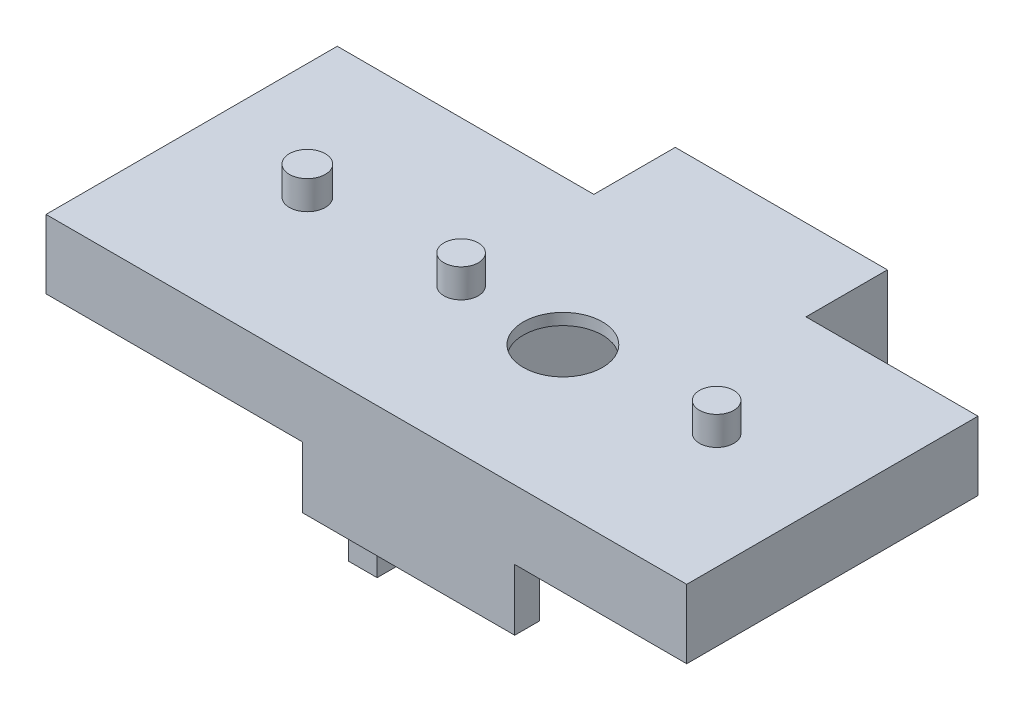
ISO-10303-21;
HEADER;
FILE_DESCRIPTION(('STEP AP214'),'2;1');
FILE_NAME('part.step','',(''),(''),'','','');
FILE_SCHEMA(('AUTOMOTIVE_DESIGN { 1 0 10303 214 1 1 1 1 }'));
ENDSEC;
DATA;
#1=APPLICATION_CONTEXT('core data for automotive mechanical design processes');
#2=APPLICATION_PROTOCOL_DEFINITION('international standard','automotive_design',2000,#1);
#3=PRODUCT_CONTEXT('',#1,'mechanical');
#4=PRODUCT('Part','Part','',(#3));
#5=PRODUCT_RELATED_PRODUCT_CATEGORY('part','',(#4));
#6=PRODUCT_DEFINITION_FORMATION('','',#4);
#7=PRODUCT_DEFINITION_CONTEXT('part definition',#1,'design');
#8=PRODUCT_DEFINITION('design','',#6,#7);
#9=PRODUCT_DEFINITION_SHAPE('','',#8);
#10=(LENGTH_UNIT() NAMED_UNIT(*) SI_UNIT(.MILLI.,.METRE.));
#11=(NAMED_UNIT(*) PLANE_ANGLE_UNIT() SI_UNIT($,.RADIAN.));
#12=(NAMED_UNIT(*) SI_UNIT($,.STERADIAN.) SOLID_ANGLE_UNIT());
#13=UNCERTAINTY_MEASURE_WITH_UNIT(LENGTH_MEASURE(1.E-05),#10,'distance_accuracy_value','');
#14=(GEOMETRIC_REPRESENTATION_CONTEXT(3) GLOBAL_UNCERTAINTY_ASSIGNED_CONTEXT((#13)) GLOBAL_UNIT_ASSIGNED_CONTEXT((#10,
#11,#12)) REPRESENTATION_CONTEXT('',''));
#15=CARTESIAN_POINT('',(0.,0.,0.));
#16=DIRECTION('',(0.,0.,1.));
#17=DIRECTION('',(1.,0.,0.));
#18=AXIS2_PLACEMENT_3D('',#15,#16,#17);
#19=CARTESIAN_POINT('',(0.,0.,0.));
#20=DIRECTION('',(1.,0.,0.));
#21=DIRECTION('',(0.,0.,-1.));
#22=AXIS2_PLACEMENT_3D('',#19,#20,#21);
#23=PLANE('',#22);
#24=CARTESIAN_POINT('',(0.,-13.,-24.2));
#25=DIRECTION('',(1.,0.,0.));
#26=DIRECTION('',(0.,0.,-1.));
#27=AXIS2_PLACEMENT_3D('',#24,#25,#26);
#28=CIRCLE('',#27,2.2);
#29=CARTESIAN_POINT('',(0.,-13.,-26.4));
#30=VERTEX_POINT('',#29);
#31=EDGE_CURVE('E408',#30,#30,#28,.T.);
#32=ORIENTED_EDGE('',*,*,#31,.T.);
#33=EDGE_LOOP('',(#32));
#34=FACE_BOUND('',#33,.T.);
#35=CARTESIAN_POINT('',(0.,-3.1,-24.2));
#36=DIRECTION('',(1.,0.,0.));
#37=DIRECTION('',(0.,0.,-1.));
#38=AXIS2_PLACEMENT_3D('',#35,#36,#37);
#39=CIRCLE('',#38,2.2);
#40=CARTESIAN_POINT('',(0.,-3.1,-26.4));
#41=VERTEX_POINT('',#40);
#42=EDGE_CURVE('E413',#41,#41,#39,.T.);
#43=ORIENTED_EDGE('',*,*,#42,.T.);
#44=EDGE_LOOP('',(#43));
#45=FACE_BOUND('',#44,.T.);
#46=CARTESIAN_POINT('',(0.,-13.,24.8));
#47=DIRECTION('',(1.,0.,0.));
#48=DIRECTION('',(0.,0.,-1.));
#49=AXIS2_PLACEMENT_3D('',#46,#47,#48);
#50=CIRCLE('',#49,2.2);
#51=CARTESIAN_POINT('',(0.,-13.,22.6));
#52=VERTEX_POINT('',#51);
#53=EDGE_CURVE('E421',#52,#52,#50,.T.);
#54=ORIENTED_EDGE('',*,*,#53,.T.);
#55=EDGE_LOOP('',(#54));
#56=FACE_BOUND('',#55,.T.);
#57=CARTESIAN_POINT('',(0.,-3.1,24.8));
#58=DIRECTION('',(1.,0.,0.));
#59=DIRECTION('',(0.,0.,-1.));
#60=AXIS2_PLACEMENT_3D('',#57,#58,#59);
#61=CIRCLE('',#60,2.2);
#62=CARTESIAN_POINT('',(0.,-3.1,22.6));
#63=VERTEX_POINT('',#62);
#64=EDGE_CURVE('E429',#63,#63,#61,.T.);
#65=ORIENTED_EDGE('',*,*,#64,.T.);
#66=EDGE_LOOP('',(#65));
#67=FACE_BOUND('',#66,.T.);
#68=DIRECTION('',(0.,0.,1.));
#69=VECTOR('',#68,1.);
#70=CARTESIAN_POINT('',(0.,5.,36.5));
#71=LINE('',#70,#69);
#72=CARTESIAN_POINT('',(0.,4.99999999999999,-14.3));
#73=VERTEX_POINT('',#72);
#74=CARTESIAN_POINT('',(0.,5.,36.5));
#75=VERTEX_POINT('',#74);
#76=EDGE_CURVE('E222',#73,#75,#71,.T.);
#77=ORIENTED_EDGE('',*,*,#76,.F.);
#78=DIRECTION('',(0.,-1.,0.));
#79=VECTOR('',#78,1.);
#80=CARTESIAN_POINT('',(0.,17.,-14.3));
#81=LINE('',#80,#79);
#82=CARTESIAN_POINT('',(0.,17.,-14.3));
#83=VERTEX_POINT('',#82);
#84=EDGE_CURVE('E57',#83,#73,#81,.T.);
#85=ORIENTED_EDGE('',*,*,#84,.F.);
#86=DIRECTION('',(0.,0.,1.));
#87=VECTOR('',#86,1.);
#88=CARTESIAN_POINT('',(0.,17.,28.5));
#89=LINE('',#88,#87);
#90=CARTESIAN_POINT('',(0.,17.,-28.5));
#91=VERTEX_POINT('',#90);
#92=EDGE_CURVE('E456',#91,#83,#89,.T.);
#93=ORIENTED_EDGE('',*,*,#92,.F.);
#94=DIRECTION('',(0.,1.,0.));
#95=VECTOR('',#94,1.);
#96=CARTESIAN_POINT('',(0.,17.,-28.5));
#97=LINE('',#96,#95);
#98=CARTESIAN_POINT('',(0.,-17.,-28.5));
#99=VERTEX_POINT('',#98);
#100=EDGE_CURVE('E437',#99,#91,#97,.T.);
#101=ORIENTED_EDGE('',*,*,#100,.F.);
#102=DIRECTION('',(0.,0.,-1.));
#103=VECTOR('',#102,1.);
#104=CARTESIAN_POINT('',(0.,-17.,28.5));
#105=LINE('',#104,#103);
#106=CARTESIAN_POINT('',(0.,-17.,28.5));
#107=VERTEX_POINT('',#106);
#108=EDGE_CURVE('E446',#107,#99,#105,.T.);
#109=ORIENTED_EDGE('',*,*,#108,.F.);
#110=DIRECTION('',(0.,-1.,0.));
#111=VECTOR('',#110,1.);
#112=CARTESIAN_POINT('',(0.,17.,28.5));
#113=LINE('',#112,#111);
#114=CARTESIAN_POINT('',(0.,-5.6960506008831,28.5));
#115=VERTEX_POINT('',#114);
#116=EDGE_CURVE('E459',#115,#107,#113,.T.);
#117=ORIENTED_EDGE('',*,*,#116,.F.);
#118=DIRECTION('',(0.,0.,-1.));
#119=VECTOR('',#118,1.);
#120=CARTESIAN_POINT('',(0.,-5.6960506008831,36.5));
#121=LINE('',#120,#119);
#122=CARTESIAN_POINT('',(0.,-5.6960506008831,36.5));
#123=VERTEX_POINT('',#122);
#124=EDGE_CURVE('E379',#123,#115,#121,.T.);
#125=ORIENTED_EDGE('',*,*,#124,.F.);
#126=DIRECTION('',(0.,-1.,0.));
#127=VECTOR('',#126,1.);
#128=CARTESIAN_POINT('',(0.,-5.6960506008831,36.5));
#129=LINE('',#128,#127);
#130=EDGE_CURVE('E63',#75,#123,#129,.T.);
#131=ORIENTED_EDGE('',*,*,#130,.F.);
#132=EDGE_LOOP('',(#77,#85,#93,#101,#109,#117,#125,#131));
#133=FACE_BOUND('',#132,.T.);
#134=ADVANCED_FACE('F41',(#34,#45,#56,#67,#133),#23,.F.);
#135=CARTESIAN_POINT('',(37.,0.,0.));
#136=DIRECTION('',(-1.,0.,0.));
#137=DIRECTION('',(0.,0.,1.));
#138=AXIS2_PLACEMENT_3D('',#135,#136,#137);
#139=PLANE('',#138);
#140=DIRECTION('',(0.,1.,0.));
#141=VECTOR('',#140,1.);
#142=CARTESIAN_POINT('',(37.,17.,-14.3));
#143=LINE('',#142,#141);
#144=CARTESIAN_POINT('',(37.,5.,-14.3));
#145=VERTEX_POINT('',#144);
#146=CARTESIAN_POINT('',(37.,17.,-14.3));
#147=VERTEX_POINT('',#146);
#148=EDGE_CURVE('E249',#145,#147,#143,.T.);
#149=ORIENTED_EDGE('',*,*,#148,.F.);
#150=DIRECTION('',(0.,0.,-1.));
#151=VECTOR('',#150,1.);
#152=CARTESIAN_POINT('',(37.,5.,36.5));
#153=LINE('',#152,#151);
#154=CARTESIAN_POINT('',(37.,5.,36.5));
#155=VERTEX_POINT('',#154);
#156=EDGE_CURVE('E245',#155,#145,#153,.T.);
#157=ORIENTED_EDGE('',*,*,#156,.F.);
#158=DIRECTION('',(0.,1.,0.));
#159=VECTOR('',#158,1.);
#160=CARTESIAN_POINT('',(37.,17.,36.5));
#161=LINE('',#160,#159);
#162=CARTESIAN_POINT('',(37.,-5.6960506008831,36.5));
#163=VERTEX_POINT('',#162);
#164=EDGE_CURVE('E205',#163,#155,#161,.T.);
#165=ORIENTED_EDGE('',*,*,#164,.F.);
#166=DIRECTION('',(0.,0.,-1.));
#167=VECTOR('',#166,1.);
#168=CARTESIAN_POINT('',(37.,-5.6960506008831,36.5));
#169=LINE('',#168,#167);
#170=CARTESIAN_POINT('',(37.,-5.6960506008831,32.1713747041326));
#171=VERTEX_POINT('',#170);
#172=EDGE_CURVE('E321',#163,#171,#169,.T.);
#173=ORIENTED_EDGE('',*,*,#172,.T.);
#174=DIRECTION('',(0.,1.,0.));
#175=VECTOR('',#174,1.);
#176=CARTESIAN_POINT('',(37.,-5.6960506008831,32.1713747041326));
#177=LINE('',#176,#175);
#178=CARTESIAN_POINT('',(37.,2.08946819583389,32.1713747041326));
#179=VERTEX_POINT('',#178);
#180=EDGE_CURVE('E324',#171,#179,#177,.T.);
#181=ORIENTED_EDGE('',*,*,#180,.T.);
#182=DIRECTION('',(0.,0.,-1.));
#183=VECTOR('',#182,1.);
#184=CARTESIAN_POINT('',(37.,2.08946819583389,32.1713747041326));
#185=LINE('',#184,#183);
#186=CARTESIAN_POINT('',(37.,2.08946819583389,-28.5));
#187=VERTEX_POINT('',#186);
#188=EDGE_CURVE('E328',#179,#187,#185,.T.);
#189=ORIENTED_EDGE('',*,*,#188,.T.);
#190=DIRECTION('',(0.,1.,0.));
#191=VECTOR('',#190,1.);
#192=CARTESIAN_POINT('',(37.,17.,-28.5));
#193=LINE('',#192,#191);
#194=CARTESIAN_POINT('',(37.,17.,-28.5));
#195=VERTEX_POINT('',#194);
#196=EDGE_CURVE('E298',#187,#195,#193,.T.);
#197=ORIENTED_EDGE('',*,*,#196,.T.);
#198=DIRECTION('',(0.,0.,1.));
#199=VECTOR('',#198,1.);
#200=CARTESIAN_POINT('',(37.,17.,28.5));
#201=LINE('',#200,#199);
#202=EDGE_CURVE('E388',#195,#147,#201,.T.);
#203=ORIENTED_EDGE('',*,*,#202,.T.);
#204=EDGE_LOOP('',(#149,#157,#165,#173,#181,#189,#197,#203));
#205=FACE_BOUND('',#204,.T.);
#206=ADVANCED_FACE('F547',(#205),#139,.F.);
#207=CARTESIAN_POINT('',(37.,12.,-28.5));
#208=DIRECTION('',(0.,1.,0.));
#209=DIRECTION('',(0.,0.,1.));
#210=AXIS2_PLACEMENT_3D('',#207,#208,#209);
#211=PLANE('',#210);
#212=DIRECTION('',(0.,0.,1.));
#213=VECTOR('',#212,1.);
#214=CARTESIAN_POINT('',(31.,12.,-28.5));
#215=LINE('',#214,#213);
#216=CARTESIAN_POINT('',(31.,12.,-28.5));
#217=VERTEX_POINT('',#216);
#218=CARTESIAN_POINT('',(31.,12.,-19.5));
#219=VERTEX_POINT('',#218);
#220=EDGE_CURVE('E276',#217,#219,#215,.T.);
#221=ORIENTED_EDGE('',*,*,#220,.T.);
#222=DIRECTION('',(-1.,0.,0.));
#223=VECTOR('',#222,1.);
#224=CARTESIAN_POINT('',(37.,12.,-19.5));
#225=LINE('',#224,#223);
#226=CARTESIAN_POINT('',(5.,12.,-19.5));
#227=VERTEX_POINT('',#226);
#228=EDGE_CURVE('E312',#219,#227,#225,.T.);
#229=ORIENTED_EDGE('',*,*,#228,.T.);
#230=DIRECTION('',(0.,0.,-1.));
#231=VECTOR('',#230,1.);
#232=CARTESIAN_POINT('',(5.,12.,-28.5));
#233=LINE('',#232,#231);
#234=CARTESIAN_POINT('',(5.,12.,-28.5));
#235=VERTEX_POINT('',#234);
#236=EDGE_CURVE('E303',#227,#235,#233,.T.);
#237=ORIENTED_EDGE('',*,*,#236,.T.);
#238=DIRECTION('',(-1.,0.,0.));
#239=VECTOR('',#238,1.);
#240=CARTESIAN_POINT('',(37.,12.,-28.5));
#241=LINE('',#240,#239);
#242=EDGE_CURVE('E302',#217,#235,#241,.T.);
#243=ORIENTED_EDGE('',*,*,#242,.F.);
#244=EDGE_LOOP('',(#221,#229,#237,#243));
#245=FACE_BOUND('',#244,.T.);
#246=ADVANCED_FACE('F531',(#245),#211,.F.);
#247=CARTESIAN_POINT('',(37.,10.5,20.));
#248=DIRECTION('',(0.,1.,0.));
#249=DIRECTION('',(0.,0.,1.));
#250=AXIS2_PLACEMENT_3D('',#247,#248,#249);
#251=PLANE('',#250);
#252=DIRECTION('',(0.,0.,1.));
#253=VECTOR('',#252,1.);
#254=CARTESIAN_POINT('',(31.,10.5,-28.5));
#255=LINE('',#254,#253);
#256=CARTESIAN_POINT('',(31.,10.5,20.));
#257=VERTEX_POINT('',#256);
#258=CARTESIAN_POINT('',(31.,10.5,29.6551085278622));
#259=VERTEX_POINT('',#258);
#260=EDGE_CURVE('E286',#257,#259,#255,.T.);
#261=ORIENTED_EDGE('',*,*,#260,.T.);
#262=DIRECTION('',(-1.,0.,0.));
#263=VECTOR('',#262,1.);
#264=CARTESIAN_POINT('',(37.,10.5,29.6551085278622));
#265=LINE('',#264,#263);
#266=CARTESIAN_POINT('',(5.,10.5,29.6551085278622));
#267=VERTEX_POINT('',#266);
#268=EDGE_CURVE('E332',#259,#267,#265,.T.);
#269=ORIENTED_EDGE('',*,*,#268,.T.);
#270=DIRECTION('',(0.,0.,-1.));
#271=VECTOR('',#270,1.);
#272=CARTESIAN_POINT('',(5.,10.5,20.));
#273=LINE('',#272,#271);
#274=CARTESIAN_POINT('',(5.,10.5,20.));
#275=VERTEX_POINT('',#274);
#276=EDGE_CURVE('E393',#267,#275,#273,.T.);
#277=ORIENTED_EDGE('',*,*,#276,.T.);
#278=DIRECTION('',(-1.,0.,0.));
#279=VECTOR('',#278,1.);
#280=CARTESIAN_POINT('',(37.,10.5,20.));
#281=LINE('',#280,#279);
#282=EDGE_CURVE('E404',#257,#275,#281,.T.);
#283=ORIENTED_EDGE('',*,*,#282,.F.);
#284=EDGE_LOOP('',(#261,#269,#277,#283));
#285=FACE_BOUND('',#284,.T.);
#286=ADVANCED_FACE('F556',(#285),#251,.F.);
#287=CARTESIAN_POINT('',(37.,10.5,29.6551085278622));
#288=DIRECTION('',(0.,0.,1.));
#289=DIRECTION('',(1.,0.,0.));
#290=AXIS2_PLACEMENT_3D('',#287,#288,#289);
#291=PLANE('',#290);
#292=DIRECTION('',(0.,1.,0.));
#293=VECTOR('',#292,1.);
#294=CARTESIAN_POINT('',(31.,2.08946819583389,29.6551085278622));
#295=LINE('',#294,#293);
#296=CARTESIAN_POINT('',(31.,2.08946819583389,29.6551085278622));
#297=VERTEX_POINT('',#296);
#298=EDGE_CURVE('E279',#297,#259,#295,.T.);
#299=ORIENTED_EDGE('',*,*,#298,.F.);
#300=DIRECTION('',(-1.,0.,0.));
#301=VECTOR('',#300,1.);
#302=CARTESIAN_POINT('',(37.,2.08946819583389,29.6551085278622));
#303=LINE('',#302,#301);
#304=CARTESIAN_POINT('',(5.,2.08946819583389,29.6551085278622));
#305=VERTEX_POINT('',#304);
#306=EDGE_CURVE('E344',#297,#305,#303,.T.);
#307=ORIENTED_EDGE('',*,*,#306,.T.);
#308=DIRECTION('',(0.,1.,0.));
#309=VECTOR('',#308,1.);
#310=CARTESIAN_POINT('',(5.,10.5,29.6551085278622));
#311=LINE('',#310,#309);
#312=EDGE_CURVE('E325',#305,#267,#311,.T.);
#313=ORIENTED_EDGE('',*,*,#312,.T.);
#314=ORIENTED_EDGE('',*,*,#268,.F.);
#315=EDGE_LOOP('',(#299,#307,#313,#314));
#316=FACE_BOUND('',#315,.T.);
#317=ADVANCED_FACE('F554',(#316),#291,.F.);
#318=CARTESIAN_POINT('',(5.,0.,0.));
#319=DIRECTION('',(1.,0.,0.));
#320=DIRECTION('',(0.,0.,-1.));
#321=AXIS2_PLACEMENT_3D('',#318,#319,#320);
#322=PLANE('',#321);
#323=CARTESIAN_POINT('',(5.,-3.1,-24.2));
#324=DIRECTION('',(1.,0.,0.));
#325=DIRECTION('',(0.,0.,-1.));
#326=AXIS2_PLACEMENT_3D('',#323,#324,#325);
#327=CIRCLE('',#326,2.2);
#328=CARTESIAN_POINT('',(5.,-3.1,-26.4));
#329=VERTEX_POINT('',#328);
#330=EDGE_CURVE('E417',#329,#329,#327,.T.);
#331=ORIENTED_EDGE('',*,*,#330,.F.);
#332=EDGE_LOOP('',(#331));
#333=FACE_BOUND('',#332,.T.);
#334=CARTESIAN_POINT('',(5.,-3.1,24.8));
#335=DIRECTION('',(1.,0.,0.));
#336=DIRECTION('',(0.,0.,-1.));
#337=AXIS2_PLACEMENT_3D('',#334,#335,#336);
#338=CIRCLE('',#337,2.2);
#339=CARTESIAN_POINT('',(5.,-3.1,22.6));
#340=VERTEX_POINT('',#339);
#341=EDGE_CURVE('E433',#340,#340,#338,.T.);
#342=ORIENTED_EDGE('',*,*,#341,.F.);
#343=EDGE_LOOP('',(#342));
#344=FACE_BOUND('',#343,.T.);
#345=CARTESIAN_POINT('',(5.,-13.,24.8));
#346=DIRECTION('',(1.,0.,0.));
#347=DIRECTION('',(0.,0.,-1.));
#348=AXIS2_PLACEMENT_3D('',#345,#346,#347);
#349=CIRCLE('',#348,2.2);
#350=CARTESIAN_POINT('',(5.,-13.,22.6));
#351=VERTEX_POINT('',#350);
#352=EDGE_CURVE('E425',#351,#351,#349,.T.);
#353=ORIENTED_EDGE('',*,*,#352,.F.);
#354=EDGE_LOOP('',(#353));
#355=FACE_BOUND('',#354,.T.);
#356=CARTESIAN_POINT('',(5.,-13.,-24.2));
#357=DIRECTION('',(1.,0.,0.));
#358=DIRECTION('',(0.,0.,-1.));
#359=AXIS2_PLACEMENT_3D('',#356,#357,#358);
#360=CIRCLE('',#359,2.2);
#361=CARTESIAN_POINT('',(5.,-13.,-26.4));
#362=VERTEX_POINT('',#361);
#363=EDGE_CURVE('E409',#362,#362,#360,.T.);
#364=ORIENTED_EDGE('',*,*,#363,.F.);
#365=EDGE_LOOP('',(#364));
#366=FACE_BOUND('',#365,.T.);
#367=DIRECTION('',(0.,-1.,0.));
#368=VECTOR('',#367,1.);
#369=CARTESIAN_POINT('',(5.,12.,-19.5));
#370=LINE('',#369,#368);
#371=CARTESIAN_POINT('',(5.,15.,-19.5));
#372=VERTEX_POINT('',#371);
#373=EDGE_CURVE('E297',#372,#227,#370,.T.);
#374=ORIENTED_EDGE('',*,*,#373,.F.);
#375=DIRECTION('',(0.,0.,-1.));
#376=VECTOR('',#375,1.);
#377=CARTESIAN_POINT('',(5.,15.,-12.));
#378=LINE('',#377,#376);
#379=CARTESIAN_POINT('',(5.,15.,20.));
#380=VERTEX_POINT('',#379);
#381=EDGE_CURVE('E392',#380,#372,#378,.T.);
#382=ORIENTED_EDGE('',*,*,#381,.F.);
#383=DIRECTION('',(0.,1.,0.));
#384=VECTOR('',#383,1.);
#385=CARTESIAN_POINT('',(5.,15.,20.));
#386=LINE('',#385,#384);
#387=EDGE_CURVE('E396',#275,#380,#386,.T.);
#388=ORIENTED_EDGE('',*,*,#387,.F.);
#389=ORIENTED_EDGE('',*,*,#276,.F.);
#390=ORIENTED_EDGE('',*,*,#312,.F.);
#391=DIRECTION('',(0.,0.,-1.));
#392=VECTOR('',#391,1.);
#393=CARTESIAN_POINT('',(5.,2.08946819583389,32.1713747041326));
#394=LINE('',#393,#392);
#395=CARTESIAN_POINT('',(5.,2.08946819583389,32.1713747041326));
#396=VERTEX_POINT('',#395);
#397=EDGE_CURVE('E335',#396,#305,#394,.T.);
#398=ORIENTED_EDGE('',*,*,#397,.F.);
#399=DIRECTION('',(0.,1.,0.));
#400=VECTOR('',#399,1.);
#401=CARTESIAN_POINT('',(5.,-5.6960506008831,32.1713747041326));
#402=LINE('',#401,#400);
#403=CARTESIAN_POINT('',(5.,-5.6960506008831,32.1713747041326));
#404=VERTEX_POINT('',#403);
#405=EDGE_CURVE('E320',#404,#396,#402,.T.);
#406=ORIENTED_EDGE('',*,*,#405,.F.);
#407=DIRECTION('',(0.,0.,-1.));
#408=VECTOR('',#407,1.);
#409=CARTESIAN_POINT('',(5.,-5.6960506008831,36.5));
#410=LINE('',#409,#408);
#411=CARTESIAN_POINT('',(5.,-5.6960506008831,28.5));
#412=VERTEX_POINT('',#411);
#413=EDGE_CURVE('E204',#404,#412,#410,.T.);
#414=ORIENTED_EDGE('',*,*,#413,.T.);
#415=DIRECTION('',(0.,-1.,0.));
#416=VECTOR('',#415,1.);
#417=CARTESIAN_POINT('',(5.,17.,28.5));
#418=LINE('',#417,#416);
#419=CARTESIAN_POINT('',(5.,-17.,28.5));
#420=VERTEX_POINT('',#419);
#421=EDGE_CURVE('E445',#412,#420,#418,.T.);
#422=ORIENTED_EDGE('',*,*,#421,.T.);
#423=DIRECTION('',(0.,0.,-1.));
#424=VECTOR('',#423,1.);
#425=CARTESIAN_POINT('',(5.,-17.,28.5));
#426=LINE('',#425,#424);
#427=CARTESIAN_POINT('',(5.,-17.,-28.5));
#428=VERTEX_POINT('',#427);
#429=EDGE_CURVE('E449',#420,#428,#426,.T.);
#430=ORIENTED_EDGE('',*,*,#429,.T.);
#431=DIRECTION('',(0.,1.,0.));
#432=VECTOR('',#431,1.);
#433=CARTESIAN_POINT('',(5.,17.,-28.5));
#434=LINE('',#433,#432);
#435=EDGE_CURVE('E441',#428,#235,#434,.T.);
#436=ORIENTED_EDGE('',*,*,#435,.T.);
#437=ORIENTED_EDGE('',*,*,#236,.F.);
#438=EDGE_LOOP('',(#374,#382,#388,#389,#390,#398,#406,#414,#422,#430,#436,#437));
#439=FACE_BOUND('',#438,.T.);
#440=ADVANCED_FACE('F522',(#333,#344,#355,#366,#439),#322,.T.);
#441=CARTESIAN_POINT('',(37.,15.,20.));
#442=DIRECTION('',(0.,0.,1.));
#443=DIRECTION('',(0.,-1.,0.));
#444=AXIS2_PLACEMENT_3D('',#441,#442,#443);
#445=PLANE('',#444);
#446=DIRECTION('',(0.,1.,0.));
#447=VECTOR('',#446,1.);
#448=CARTESIAN_POINT('',(31.,10.5,20.));
#449=LINE('',#448,#447);
#450=CARTESIAN_POINT('',(31.,15.,20.));
#451=VERTEX_POINT('',#450);
#452=EDGE_CURVE('E354',#257,#451,#449,.T.);
#453=ORIENTED_EDGE('',*,*,#452,.F.);
#454=ORIENTED_EDGE('',*,*,#282,.T.);
#455=ORIENTED_EDGE('',*,*,#387,.T.);
#456=DIRECTION('',(-1.,0.,0.));
#457=VECTOR('',#456,1.);
#458=CARTESIAN_POINT('',(37.,15.,20.));
#459=LINE('',#458,#457);
#460=EDGE_CURVE('E391',#451,#380,#459,.T.);
#461=ORIENTED_EDGE('',*,*,#460,.F.);
#462=EDGE_LOOP('',(#453,#454,#455,#461));
#463=FACE_BOUND('',#462,.T.);
#464=ADVANCED_FACE('F507',(#463),#445,.F.);
#465=CARTESIAN_POINT('',(37.,15.,-12.));
#466=DIRECTION('',(0.,1.,0.));
#467=DIRECTION('',(0.,0.,1.));
#468=AXIS2_PLACEMENT_3D('',#465,#466,#467);
#469=PLANE('',#468);
#470=CARTESIAN_POINT('',(20.,15.,11.1));
#471=DIRECTION('',(0.,1.,0.));
#472=DIRECTION('',(0.,0.,1.));
#473=AXIS2_PLACEMENT_3D('',#470,#471,#472);
#474=CIRCLE('',#473,6.9);
#475=CARTESIAN_POINT('',(20.,15.,18.));
#476=VERTEX_POINT('',#475);
#477=EDGE_CURVE('E387',#476,#476,#474,.T.);
#478=ORIENTED_EDGE('',*,*,#477,.T.);
#479=EDGE_LOOP('',(#478));
#480=FACE_BOUND('',#479,.T.);
#481=DIRECTION('',(0.,0.,1.));
#482=VECTOR('',#481,1.);
#483=CARTESIAN_POINT('',(31.,15.0000000000001,-19.5));
#484=LINE('',#483,#482);
#485=CARTESIAN_POINT('',(31.,15.0000000000001,-19.5));
#486=VERTEX_POINT('',#485);
#487=EDGE_CURVE('E359',#486,#451,#484,.T.);
#488=ORIENTED_EDGE('',*,*,#487,.T.);
#489=ORIENTED_EDGE('',*,*,#460,.T.);
#490=ORIENTED_EDGE('',*,*,#381,.T.);
#491=DIRECTION('',(-1.,0.,0.));
#492=VECTOR('',#491,1.);
#493=CARTESIAN_POINT('',(37.,15.,-19.5));
#494=LINE('',#493,#492);
#495=EDGE_CURVE('E316',#486,#372,#494,.T.);
#496=ORIENTED_EDGE('',*,*,#495,.F.);
#497=EDGE_LOOP('',(#488,#489,#490,#496));
#498=FACE_BOUND('',#497,.T.);
#499=ADVANCED_FACE('F503',(#480,#498),#469,.F.);
#500=CARTESIAN_POINT('',(5.,17.,28.5));
#501=DIRECTION('',(0.,0.,-1.));
#502=DIRECTION('',(0.,1.,0.));
#503=AXIS2_PLACEMENT_3D('',#500,#501,#502);
#504=PLANE('',#503);
#505=DIRECTION('',(1.,0.,0.));
#506=VECTOR('',#505,1.);
#507=CARTESIAN_POINT('',(5.,-5.6960506008831,28.5));
#508=LINE('',#507,#506);
#509=EDGE_CURVE('E365',#115,#412,#508,.T.);
#510=ORIENTED_EDGE('',*,*,#509,.F.);
#511=ORIENTED_EDGE('',*,*,#116,.T.);
#512=DIRECTION('',(-1.,0.,0.));
#513=VECTOR('',#512,1.);
#514=CARTESIAN_POINT('',(5.,-17.,28.5));
#515=LINE('',#514,#513);
#516=EDGE_CURVE('E467',#420,#107,#515,.T.);
#517=ORIENTED_EDGE('',*,*,#516,.F.);
#518=ORIENTED_EDGE('',*,*,#421,.F.);
#519=EDGE_LOOP('',(#510,#511,#517,#518));
#520=FACE_BOUND('',#519,.T.);
#521=ADVANCED_FACE('F506',(#520),#504,.F.);
#522=CARTESIAN_POINT('',(5.,17.,-28.5));
#523=DIRECTION('',(0.,0.,1.));
#524=DIRECTION('',(1.,0.,0.));
#525=AXIS2_PLACEMENT_3D('',#522,#523,#524);
#526=PLANE('',#525);
#527=ORIENTED_EDGE('',*,*,#100,.T.);
#528=DIRECTION('',(-1.,0.,0.));
#529=VECTOR('',#528,1.);
#530=CARTESIAN_POINT('',(5.,17.,-28.5));
#531=LINE('',#530,#529);
#532=EDGE_CURVE('E471',#195,#91,#531,.T.);
#533=ORIENTED_EDGE('',*,*,#532,.F.);
#534=ORIENTED_EDGE('',*,*,#196,.F.);
#535=DIRECTION('',(-1.,0.,0.));
#536=VECTOR('',#535,1.);
#537=CARTESIAN_POINT('',(37.,2.08946819583389,-28.5));
#538=LINE('',#537,#536);
#539=CARTESIAN_POINT('',(31.,2.08946819583389,-28.5));
#540=VERTEX_POINT('',#539);
#541=EDGE_CURVE('E280',#187,#540,#538,.T.);
#542=ORIENTED_EDGE('',*,*,#541,.T.);
#543=DIRECTION('',(0.,1.,0.));
#544=VECTOR('',#543,1.);
#545=CARTESIAN_POINT('',(31.,2.08946819583389,-28.5));
#546=LINE('',#545,#544);
#547=EDGE_CURVE('E283',#540,#217,#546,.T.);
#548=ORIENTED_EDGE('',*,*,#547,.T.);
#549=ORIENTED_EDGE('',*,*,#242,.T.);
#550=ORIENTED_EDGE('',*,*,#435,.F.);
#551=DIRECTION('',(-1.,0.,0.));
#552=VECTOR('',#551,1.);
#553=CARTESIAN_POINT('',(5.,-17.,-28.5));
#554=LINE('',#553,#552);
#555=EDGE_CURVE('E452',#428,#99,#554,.T.);
#556=ORIENTED_EDGE('',*,*,#555,.T.);
#557=EDGE_LOOP('',(#527,#533,#534,#542,#548,#549,#550,#556));
#558=FACE_BOUND('',#557,.T.);
#559=ADVANCED_FACE('F43',(#558),#526,.F.);
#560=CARTESIAN_POINT('',(5.,17.,28.5));
#561=DIRECTION('',(0.,-1.,0.));
#562=DIRECTION('',(0.,0.,-1.));
#563=AXIS2_PLACEMENT_3D('',#560,#561,#562);
#564=PLANE('',#563);
#565=CARTESIAN_POINT('',(-24.57,17.,11.1));
#566=DIRECTION('',(0.,-1.,0.));
#567=DIRECTION('',(0.,0.,-1.));
#568=AXIS2_PLACEMENT_3D('',#565,#566,#567);
#569=CIRCLE('',#568,3.12908993540187);
#570=CARTESIAN_POINT('',(-24.57,17.,7.97091006459815));
#571=VERTEX_POINT('',#570);
#572=EDGE_CURVE('E11',#571,#571,#569,.F.);
#573=ORIENTED_EDGE('',*,*,#572,.F.);
#574=EDGE_LOOP('',(#573));
#575=FACE_BOUND('',#574,.T.);
#576=CARTESIAN_POINT('',(46.82,17.,11.1));
#577=DIRECTION('',(0.,-1.,0.));
#578=DIRECTION('',(0.,0.,-1.));
#579=AXIS2_PLACEMENT_3D('',#576,#577,#578);
#580=CIRCLE('',#579,3.);
#581=CARTESIAN_POINT('',(46.82,17.,8.10000000000002));
#582=VERTEX_POINT('',#581);
#583=EDGE_CURVE('E50',#582,#582,#580,.F.);
#584=ORIENTED_EDGE('',*,*,#583,.F.);
#585=EDGE_LOOP('',(#584));
#586=FACE_BOUND('',#585,.T.);
#587=CARTESIAN_POINT('',(2.25,17.,11.1));
#588=DIRECTION('',(0.,-1.,0.));
#589=DIRECTION('',(0.,0.,-1.));
#590=AXIS2_PLACEMENT_3D('',#587,#588,#589);
#591=CIRCLE('',#590,3.);
#592=CARTESIAN_POINT('',(2.25,17.,8.10000000000002));
#593=VERTEX_POINT('',#592);
#594=EDGE_CURVE('E475',#593,#593,#591,.F.);
#595=ORIENTED_EDGE('',*,*,#594,.F.);
#596=EDGE_LOOP('',(#595));
#597=FACE_BOUND('',#596,.T.);
#598=CARTESIAN_POINT('',(20.,17.,11.1));
#599=DIRECTION('',(0.,1.,0.));
#600=DIRECTION('',(0.,0.,1.));
#601=AXIS2_PLACEMENT_3D('',#598,#599,#600);
#602=CIRCLE('',#601,6.9);
#603=CARTESIAN_POINT('',(20.,17.,18.));
#604=VERTEX_POINT('',#603);
#605=EDGE_CURVE('E383',#604,#604,#602,.T.);
#606=ORIENTED_EDGE('',*,*,#605,.F.);
#607=EDGE_LOOP('',(#606));
#608=FACE_BOUND('',#607,.T.);
#609=ORIENTED_EDGE('',*,*,#92,.T.);
#610=DIRECTION('',(1.,0.,0.));
#611=VECTOR('',#610,1.);
#612=CARTESIAN_POINT('',(-44.75,17.,-14.3));
#613=LINE('',#612,#611);
#614=CARTESIAN_POINT('',(-44.75,17.,-14.3));
#615=VERTEX_POINT('',#614);
#616=EDGE_CURVE('E211',#615,#83,#613,.T.);
#617=ORIENTED_EDGE('',*,*,#616,.F.);
#618=DIRECTION('',(0.,0.,-1.));
#619=VECTOR('',#618,1.);
#620=CARTESIAN_POINT('',(-44.75,17.,36.5));
#621=LINE('',#620,#619);
#622=CARTESIAN_POINT('',(-44.75,17.,36.5));
#623=VERTEX_POINT('',#622);
#624=EDGE_CURVE('E208',#623,#615,#621,.T.);
#625=ORIENTED_EDGE('',*,*,#624,.F.);
#626=DIRECTION('',(-1.,0.,0.));
#627=VECTOR('',#626,1.);
#628=CARTESIAN_POINT('',(0.,17.,36.5));
#629=LINE('',#628,#627);
#630=CARTESIAN_POINT('',(67.,17.,36.5));
#631=VERTEX_POINT('',#630);
#632=EDGE_CURVE('E190',#631,#623,#629,.T.);
#633=ORIENTED_EDGE('',*,*,#632,.F.);
#634=DIRECTION('',(0.,0.,1.));
#635=VECTOR('',#634,1.);
#636=CARTESIAN_POINT('',(67.,17.,36.5));
#637=LINE('',#636,#635);
#638=CARTESIAN_POINT('',(67.,17.,-14.3));
#639=VERTEX_POINT('',#638);
#640=EDGE_CURVE('E255',#639,#631,#637,.T.);
#641=ORIENTED_EDGE('',*,*,#640,.F.);
#642=DIRECTION('',(-1.,0.,0.));
#643=VECTOR('',#642,1.);
#644=CARTESIAN_POINT('',(67.,17.,-14.3));
#645=LINE('',#644,#643);
#646=EDGE_CURVE('E258',#639,#147,#645,.T.);
#647=ORIENTED_EDGE('',*,*,#646,.T.);
#648=ORIENTED_EDGE('',*,*,#202,.F.);
#649=ORIENTED_EDGE('',*,*,#532,.T.);
#650=EDGE_LOOP('',(#609,#617,#625,#633,#641,#647,#648,#649));
#651=FACE_BOUND('',#650,.T.);
#652=ADVANCED_FACE('F209',(#575,#586,#597,#608,#651),#564,.F.);
#653=CARTESIAN_POINT('',(5.,-17.,28.5));
#654=DIRECTION('',(0.,1.,0.));
#655=DIRECTION('',(0.,0.,1.));
#656=AXIS2_PLACEMENT_3D('',#653,#654,#655);
#657=PLANE('',#656);
#658=ORIENTED_EDGE('',*,*,#108,.T.);
#659=ORIENTED_EDGE('',*,*,#555,.F.);
#660=ORIENTED_EDGE('',*,*,#429,.F.);
#661=ORIENTED_EDGE('',*,*,#516,.T.);
#662=EDGE_LOOP('',(#658,#659,#660,#661));
#663=FACE_BOUND('',#662,.T.);
#664=ADVANCED_FACE('F489',(#663),#657,.F.);
#665=CARTESIAN_POINT('',(5.,-3.1,24.8));
#666=DIRECTION('',(-1.,0.,0.));
#667=DIRECTION('',(0.,0.,1.));
#668=AXIS2_PLACEMENT_3D('',#665,#666,#667);
#669=CYLINDRICAL_SURFACE('',#668,2.2);
#670=ORIENTED_EDGE('',*,*,#341,.T.);
#671=EDGE_LOOP('',(#670));
#672=FACE_BOUND('',#671,.T.);
#673=ORIENTED_EDGE('',*,*,#64,.F.);
#674=EDGE_LOOP('',(#673));
#675=FACE_BOUND('',#674,.T.);
#676=ADVANCED_FACE('F583',(#672,#675),#669,.F.);
#677=CARTESIAN_POINT('',(5.,-13.,24.8));
#678=DIRECTION('',(-1.,0.,0.));
#679=DIRECTION('',(0.,0.,1.));
#680=AXIS2_PLACEMENT_3D('',#677,#678,#679);
#681=CYLINDRICAL_SURFACE('',#680,2.2);
#682=ORIENTED_EDGE('',*,*,#352,.T.);
#683=EDGE_LOOP('',(#682));
#684=FACE_BOUND('',#683,.T.);
#685=ORIENTED_EDGE('',*,*,#53,.F.);
#686=EDGE_LOOP('',(#685));
#687=FACE_BOUND('',#686,.T.);
#688=ADVANCED_FACE('F655',(#684,#687),#681,.F.);
#689=CARTESIAN_POINT('',(5.,-3.1,-24.2));
#690=DIRECTION('',(-1.,0.,0.));
#691=DIRECTION('',(0.,0.,1.));
#692=AXIS2_PLACEMENT_3D('',#689,#690,#691);
#693=CYLINDRICAL_SURFACE('',#692,2.2);
#694=ORIENTED_EDGE('',*,*,#330,.T.);
#695=EDGE_LOOP('',(#694));
#696=FACE_BOUND('',#695,.T.);
#697=ORIENTED_EDGE('',*,*,#42,.F.);
#698=EDGE_LOOP('',(#697));
#699=FACE_BOUND('',#698,.T.);
#700=ADVANCED_FACE('F650',(#696,#699),#693,.F.);
#701=CARTESIAN_POINT('',(5.,-13.,-24.2));
#702=DIRECTION('',(-1.,0.,0.));
#703=DIRECTION('',(0.,0.,1.));
#704=AXIS2_PLACEMENT_3D('',#701,#702,#703);
#705=CYLINDRICAL_SURFACE('',#704,2.2);
#706=ORIENTED_EDGE('',*,*,#363,.T.);
#707=EDGE_LOOP('',(#706));
#708=FACE_BOUND('',#707,.T.);
#709=ORIENTED_EDGE('',*,*,#31,.F.);
#710=EDGE_LOOP('',(#709));
#711=FACE_BOUND('',#710,.T.);
#712=ADVANCED_FACE('F499',(#708,#711),#705,.F.);
#713=CARTESIAN_POINT('',(20.,-2.,11.1));
#714=DIRECTION('',(0.,1.,0.));
#715=DIRECTION('',(0.,0.,1.));
#716=AXIS2_PLACEMENT_3D('',#713,#714,#715);
#717=CYLINDRICAL_SURFACE('',#716,6.9);
#718=ORIENTED_EDGE('',*,*,#605,.T.);
#719=EDGE_LOOP('',(#718));
#720=FACE_BOUND('',#719,.T.);
#721=ORIENTED_EDGE('',*,*,#477,.F.);
#722=EDGE_LOOP('',(#721));
#723=FACE_BOUND('',#722,.T.);
#724=ADVANCED_FACE('F495',(#720,#723),#717,.F.);
#725=CARTESIAN_POINT('',(5.,-5.6960506008831,36.5));
#726=DIRECTION('',(0.,1.,0.));
#727=DIRECTION('',(0.,0.,1.));
#728=AXIS2_PLACEMENT_3D('',#725,#726,#727);
#729=PLANE('',#728);
#730=ORIENTED_EDGE('',*,*,#509,.T.);
#731=ORIENTED_EDGE('',*,*,#413,.F.);
#732=DIRECTION('',(-1.,0.,0.));
#733=VECTOR('',#732,1.);
#734=CARTESIAN_POINT('',(37.,-5.6960506008831,32.1713747041326));
#735=LINE('',#734,#733);
#736=EDGE_CURVE('E351',#171,#404,#735,.T.);
#737=ORIENTED_EDGE('',*,*,#736,.F.);
#738=ORIENTED_EDGE('',*,*,#172,.F.);
#739=DIRECTION('',(1.,0.,0.));
#740=VECTOR('',#739,1.);
#741=CARTESIAN_POINT('',(5.,-5.6960506008831,36.5));
#742=LINE('',#741,#740);
#743=EDGE_CURVE('E368',#123,#163,#742,.T.);
#744=ORIENTED_EDGE('',*,*,#743,.F.);
#745=ORIENTED_EDGE('',*,*,#124,.T.);
#746=EDGE_LOOP('',(#730,#731,#737,#738,#744,#745));
#747=FACE_BOUND('',#746,.T.);
#748=ADVANCED_FACE('F498',(#747),#729,.F.);
#749=CARTESIAN_POINT('',(0.,0.,36.5));
#750=DIRECTION('',(0.,0.,-1.));
#751=DIRECTION('',(-1.,0.,0.));
#752=AXIS2_PLACEMENT_3D('',#749,#750,#751);
#753=PLANE('',#752);
#754=ORIENTED_EDGE('',*,*,#743,.T.);
#755=ORIENTED_EDGE('',*,*,#164,.T.);
#756=DIRECTION('',(-1.,0.,0.));
#757=VECTOR('',#756,1.);
#758=CARTESIAN_POINT('',(67.,5.,36.5));
#759=LINE('',#758,#757);
#760=CARTESIAN_POINT('',(67.,5.,36.5));
#761=VERTEX_POINT('',#760);
#762=EDGE_CURVE('E272',#761,#155,#759,.T.);
#763=ORIENTED_EDGE('',*,*,#762,.F.);
#764=DIRECTION('',(0.,-1.,0.));
#765=VECTOR('',#764,1.);
#766=CARTESIAN_POINT('',(67.,17.,36.5));
#767=LINE('',#766,#765);
#768=EDGE_CURVE('E199',#631,#761,#767,.T.);
#769=ORIENTED_EDGE('',*,*,#768,.F.);
#770=ORIENTED_EDGE('',*,*,#632,.T.);
#771=DIRECTION('',(0.,1.,0.));
#772=VECTOR('',#771,1.);
#773=CARTESIAN_POINT('',(-44.75,17.,36.5));
#774=LINE('',#773,#772);
#775=CARTESIAN_POINT('',(-44.75,5.,36.5));
#776=VERTEX_POINT('',#775);
#777=EDGE_CURVE('E196',#776,#623,#774,.T.);
#778=ORIENTED_EDGE('',*,*,#777,.F.);
#779=DIRECTION('',(1.,0.,0.));
#780=VECTOR('',#779,1.);
#781=CARTESIAN_POINT('',(-44.75,5.,36.5));
#782=LINE('',#781,#780);
#783=EDGE_CURVE('E234',#776,#75,#782,.T.);
#784=ORIENTED_EDGE('',*,*,#783,.T.);
#785=ORIENTED_EDGE('',*,*,#130,.T.);
#786=EDGE_LOOP('',(#754,#755,#763,#769,#770,#778,#784,#785));
#787=FACE_BOUND('',#786,.T.);
#788=ADVANCED_FACE('F193',(#787),#753,.F.);
#789=CARTESIAN_POINT('',(31.,10.5000000000001,-19.5));
#790=DIRECTION('',(1.,0.,0.));
#791=DIRECTION('',(0.,0.,-1.));
#792=AXIS2_PLACEMENT_3D('',#789,#790,#791);
#793=PLANE('',#792);
#794=DIRECTION('',(0.,1.,0.));
#795=VECTOR('',#794,1.);
#796=CARTESIAN_POINT('',(31.,10.5000000000001,-19.5));
#797=LINE('',#796,#795);
#798=EDGE_CURVE('E355',#219,#486,#797,.T.);
#799=ORIENTED_EDGE('',*,*,#798,.F.);
#800=ORIENTED_EDGE('',*,*,#220,.F.);
#801=ORIENTED_EDGE('',*,*,#547,.F.);
#802=DIRECTION('',(0.,0.,1.));
#803=VECTOR('',#802,1.);
#804=CARTESIAN_POINT('',(31.,2.08946819583389,-28.5));
#805=LINE('',#804,#803);
#806=EDGE_CURVE('E293',#540,#297,#805,.T.);
#807=ORIENTED_EDGE('',*,*,#806,.T.);
#808=ORIENTED_EDGE('',*,*,#298,.T.);
#809=ORIENTED_EDGE('',*,*,#260,.F.);
#810=ORIENTED_EDGE('',*,*,#452,.T.);
#811=ORIENTED_EDGE('',*,*,#487,.F.);
#812=EDGE_LOOP('',(#799,#800,#801,#807,#808,#809,#810,#811));
#813=FACE_BOUND('',#812,.T.);
#814=ADVANCED_FACE('F515',(#813),#793,.F.);
#815=CARTESIAN_POINT('',(37.,-5.6960506008831,32.1713747041326));
#816=DIRECTION('',(0.,0.,1.));
#817=DIRECTION('',(1.,0.,0.));
#818=AXIS2_PLACEMENT_3D('',#815,#816,#817);
#819=PLANE('',#818);
#820=ORIENTED_EDGE('',*,*,#405,.T.);
#821=DIRECTION('',(-1.,0.,0.));
#822=VECTOR('',#821,1.);
#823=CARTESIAN_POINT('',(37.,2.08946819583389,32.1713747041326));
#824=LINE('',#823,#822);
#825=EDGE_CURVE('E347',#179,#396,#824,.T.);
#826=ORIENTED_EDGE('',*,*,#825,.F.);
#827=ORIENTED_EDGE('',*,*,#180,.F.);
#828=ORIENTED_EDGE('',*,*,#736,.T.);
#829=EDGE_LOOP('',(#820,#826,#827,#828));
#830=FACE_BOUND('',#829,.T.);
#831=ADVANCED_FACE('F623',(#830),#819,.F.);
#832=CARTESIAN_POINT('',(37.,2.08946819583389,32.1713747041326));
#833=DIRECTION('',(0.,1.,0.));
#834=DIRECTION('',(0.,0.,1.));
#835=AXIS2_PLACEMENT_3D('',#832,#833,#834);
#836=PLANE('',#835);
#837=ORIENTED_EDGE('',*,*,#397,.T.);
#838=ORIENTED_EDGE('',*,*,#306,.F.);
#839=ORIENTED_EDGE('',*,*,#806,.F.);
#840=ORIENTED_EDGE('',*,*,#541,.F.);
#841=ORIENTED_EDGE('',*,*,#188,.F.);
#842=ORIENTED_EDGE('',*,*,#825,.T.);
#843=EDGE_LOOP('',(#837,#838,#839,#840,#841,#842));
#844=FACE_BOUND('',#843,.T.);
#845=ADVANCED_FACE('F551',(#844),#836,.F.);
#846=CARTESIAN_POINT('',(37.,12.,-19.5));
#847=DIRECTION('',(0.,0.,-1.));
#848=DIRECTION('',(-1.,0.,0.));
#849=AXIS2_PLACEMENT_3D('',#846,#847,#848);
#850=PLANE('',#849);
#851=ORIENTED_EDGE('',*,*,#228,.F.);
#852=ORIENTED_EDGE('',*,*,#798,.T.);
#853=ORIENTED_EDGE('',*,*,#495,.T.);
#854=ORIENTED_EDGE('',*,*,#373,.T.);
#855=EDGE_LOOP('',(#851,#852,#853,#854));
#856=FACE_BOUND('',#855,.T.);
#857=ADVANCED_FACE('F526',(#856),#850,.F.);
#858=CARTESIAN_POINT('',(67.,5.,36.5));
#859=DIRECTION('',(0.,1.,0.));
#860=DIRECTION('',(0.,0.,1.));
#861=AXIS2_PLACEMENT_3D('',#858,#859,#860);
#862=PLANE('',#861);
#863=ORIENTED_EDGE('',*,*,#156,.T.);
#864=DIRECTION('',(-1.,0.,0.));
#865=VECTOR('',#864,1.);
#866=CARTESIAN_POINT('',(67.,5.,-14.3));
#867=LINE('',#866,#865);
#868=CARTESIAN_POINT('',(67.,5.,-14.3));
#869=VERTEX_POINT('',#868);
#870=EDGE_CURVE('E268',#869,#145,#867,.T.);
#871=ORIENTED_EDGE('',*,*,#870,.F.);
#872=DIRECTION('',(0.,0.,-1.));
#873=VECTOR('',#872,1.);
#874=CARTESIAN_POINT('',(67.,5.,36.5));
#875=LINE('',#874,#873);
#876=EDGE_CURVE('E248',#761,#869,#875,.T.);
#877=ORIENTED_EDGE('',*,*,#876,.F.);
#878=ORIENTED_EDGE('',*,*,#762,.T.);
#879=EDGE_LOOP('',(#863,#871,#877,#878));
#880=FACE_BOUND('',#879,.T.);
#881=ADVANCED_FACE('F614',(#880),#862,.F.);
#882=CARTESIAN_POINT('',(67.,17.,-14.3));
#883=DIRECTION('',(0.,0.,1.));
#884=DIRECTION('',(1.,0.,0.));
#885=AXIS2_PLACEMENT_3D('',#882,#883,#884);
#886=PLANE('',#885);
#887=ORIENTED_EDGE('',*,*,#148,.T.);
#888=ORIENTED_EDGE('',*,*,#646,.F.);
#889=DIRECTION('',(0.,1.,0.));
#890=VECTOR('',#889,1.);
#891=CARTESIAN_POINT('',(67.,17.,-14.3));
#892=LINE('',#891,#890);
#893=EDGE_CURVE('E252',#869,#639,#892,.T.);
#894=ORIENTED_EDGE('',*,*,#893,.F.);
#895=ORIENTED_EDGE('',*,*,#870,.T.);
#896=EDGE_LOOP('',(#887,#888,#894,#895));
#897=FACE_BOUND('',#896,.T.);
#898=ADVANCED_FACE('F607',(#897),#886,.F.);
#899=CARTESIAN_POINT('',(67.,0.,0.));
#900=DIRECTION('',(1.,0.,0.));
#901=DIRECTION('',(0.,0.,-1.));
#902=AXIS2_PLACEMENT_3D('',#899,#900,#901);
#903=PLANE('',#902);
#904=ORIENTED_EDGE('',*,*,#768,.T.);
#905=ORIENTED_EDGE('',*,*,#876,.T.);
#906=ORIENTED_EDGE('',*,*,#893,.T.);
#907=ORIENTED_EDGE('',*,*,#640,.T.);
#908=EDGE_LOOP('',(#904,#905,#906,#907));
#909=FACE_BOUND('',#908,.T.);
#910=ADVANCED_FACE('F600',(#909),#903,.T.);
#911=CARTESIAN_POINT('',(-44.75,17.,-14.3));
#912=DIRECTION('',(0.,0.,1.));
#913=DIRECTION('',(1.,0.,0.));
#914=AXIS2_PLACEMENT_3D('',#911,#912,#913);
#915=PLANE('',#914);
#916=ORIENTED_EDGE('',*,*,#84,.T.);
#917=DIRECTION('',(1.,0.,0.));
#918=VECTOR('',#917,1.);
#919=CARTESIAN_POINT('',(-44.75,4.99999999999999,-14.3));
#920=LINE('',#919,#918);
#921=CARTESIAN_POINT('',(-44.75,4.99999999999999,-14.3));
#922=VERTEX_POINT('',#921);
#923=EDGE_CURVE('E239',#922,#73,#920,.T.);
#924=ORIENTED_EDGE('',*,*,#923,.F.);
#925=DIRECTION('',(0.,-1.,0.));
#926=VECTOR('',#925,1.);
#927=CARTESIAN_POINT('',(-44.75,17.,-14.3));
#928=LINE('',#927,#926);
#929=EDGE_CURVE('E215',#615,#922,#928,.T.);
#930=ORIENTED_EDGE('',*,*,#929,.F.);
#931=ORIENTED_EDGE('',*,*,#616,.T.);
#932=EDGE_LOOP('',(#916,#924,#930,#931));
#933=FACE_BOUND('',#932,.T.);
#934=ADVANCED_FACE('F598',(#933),#915,.F.);
#935=CARTESIAN_POINT('',(-44.75,5.,36.5));
#936=DIRECTION('',(0.,1.,0.));
#937=DIRECTION('',(0.,0.,1.));
#938=AXIS2_PLACEMENT_3D('',#935,#936,#937);
#939=PLANE('',#938);
#940=ORIENTED_EDGE('',*,*,#76,.T.);
#941=ORIENTED_EDGE('',*,*,#783,.F.);
#942=DIRECTION('',(0.,0.,1.));
#943=VECTOR('',#942,1.);
#944=CARTESIAN_POINT('',(-44.75,5.,36.5));
#945=LINE('',#944,#943);
#946=EDGE_CURVE('E219',#922,#776,#945,.T.);
#947=ORIENTED_EDGE('',*,*,#946,.F.);
#948=ORIENTED_EDGE('',*,*,#923,.T.);
#949=EDGE_LOOP('',(#940,#941,#947,#948));
#950=FACE_BOUND('',#949,.T.);
#951=ADVANCED_FACE('F595',(#950),#939,.F.);
#952=CARTESIAN_POINT('',(-44.75,0.,0.));
#953=DIRECTION('',(1.,0.,0.));
#954=DIRECTION('',(0.,0.,-1.));
#955=AXIS2_PLACEMENT_3D('',#952,#953,#954);
#956=PLANE('',#955);
#957=ORIENTED_EDGE('',*,*,#777,.T.);
#958=ORIENTED_EDGE('',*,*,#624,.T.);
#959=ORIENTED_EDGE('',*,*,#929,.T.);
#960=ORIENTED_EDGE('',*,*,#946,.T.);
#961=EDGE_LOOP('',(#957,#958,#959,#960));
#962=FACE_BOUND('',#961,.T.);
#963=ADVANCED_FACE('F217',(#962),#956,.F.);
#964=CARTESIAN_POINT('',(2.25,22.,11.1));
#965=DIRECTION('',(0.,-1.,0.));
#966=DIRECTION('',(0.,0.,-1.));
#967=AXIS2_PLACEMENT_3D('',#964,#965,#966);
#968=CYLINDRICAL_SURFACE('',#967,3.);
#969=CARTESIAN_POINT('',(2.25,22.,11.1));
#970=DIRECTION('',(0.,1.,0.));
#971=DIRECTION('',(0.,0.,1.));
#972=AXIS2_PLACEMENT_3D('',#969,#970,#971);
#973=CIRCLE('',#972,3.);
#974=CARTESIAN_POINT('',(2.25,22.,14.1));
#975=VERTEX_POINT('',#974);
#976=EDGE_CURVE('E227',#975,#975,#973,.T.);
#977=ORIENTED_EDGE('',*,*,#976,.F.);
#978=EDGE_LOOP('',(#977));
#979=FACE_BOUND('',#978,.T.);
#980=ORIENTED_EDGE('',*,*,#594,.T.);
#981=EDGE_LOOP('',(#980));
#982=FACE_BOUND('',#981,.T.);
#983=ADVANCED_FACE('F842',(#979,#982),#968,.T.);
#984=CARTESIAN_POINT('',(2.25,22.,11.1));
#985=DIRECTION('',(0.,1.,0.));
#986=DIRECTION('',(0.,0.,1.));
#987=AXIS2_PLACEMENT_3D('',#984,#985,#986);
#988=PLANE('',#987);
#989=ORIENTED_EDGE('',*,*,#976,.T.);
#990=EDGE_LOOP('',(#989));
#991=FACE_BOUND('',#990,.T.);
#992=ADVANCED_FACE('F848',(#991),#988,.T.);
#993=CARTESIAN_POINT('',(46.82,22.,11.1));
#994=DIRECTION('',(0.,-1.,0.));
#995=DIRECTION('',(0.,0.,-1.));
#996=AXIS2_PLACEMENT_3D('',#993,#994,#995);
#997=CYLINDRICAL_SURFACE('',#996,3.);
#998=CARTESIAN_POINT('',(46.82,22.,11.1));
#999=DIRECTION('',(0.,1.,0.));
#1000=DIRECTION('',(0.,0.,1.));
#1001=AXIS2_PLACEMENT_3D('',#998,#999,#1000);
#1002=CIRCLE('',#1001,3.);
#1003=CARTESIAN_POINT('',(46.82,22.,14.1));
#1004=VERTEX_POINT('',#1003);
#1005=EDGE_CURVE('E906',#1004,#1004,#1002,.T.);
#1006=ORIENTED_EDGE('',*,*,#1005,.F.);
#1007=EDGE_LOOP('',(#1006));
#1008=FACE_BOUND('',#1007,.T.);
#1009=ORIENTED_EDGE('',*,*,#583,.T.);
#1010=EDGE_LOOP('',(#1009));
#1011=FACE_BOUND('',#1010,.T.);
#1012=ADVANCED_FACE('F485',(#1008,#1011),#997,.T.);
#1013=CARTESIAN_POINT('',(46.82,22.,11.1));
#1014=DIRECTION('',(0.,1.,0.));
#1015=DIRECTION('',(0.,0.,1.));
#1016=AXIS2_PLACEMENT_3D('',#1013,#1014,#1015);
#1017=PLANE('',#1016);
#1018=ORIENTED_EDGE('',*,*,#1005,.T.);
#1019=EDGE_LOOP('',(#1018));
#1020=FACE_BOUND('',#1019,.T.);
#1021=ADVANCED_FACE('F865',(#1020),#1017,.T.);
#1022=CARTESIAN_POINT('',(-24.57,22.,11.1));
#1023=DIRECTION('',(0.,-1.,0.));
#1024=DIRECTION('',(0.,0.,-1.));
#1025=AXIS2_PLACEMENT_3D('',#1022,#1023,#1024);
#1026=CYLINDRICAL_SURFACE('',#1025,3.12908993540187);
#1027=CARTESIAN_POINT('',(-24.57,22.,11.1));
#1028=DIRECTION('',(0.,1.,0.));
#1029=DIRECTION('',(0.,0.,1.));
#1030=AXIS2_PLACEMENT_3D('',#1027,#1028,#1029);
#1031=CIRCLE('',#1030,3.12908993540187);
#1032=CARTESIAN_POINT('',(-24.57,22.,14.2290899354019));
#1033=VERTEX_POINT('',#1032);
#1034=EDGE_CURVE('E904',#1033,#1033,#1031,.T.);
#1035=ORIENTED_EDGE('',*,*,#1034,.F.);
#1036=EDGE_LOOP('',(#1035));
#1037=FACE_BOUND('',#1036,.T.);
#1038=ORIENTED_EDGE('',*,*,#572,.T.);
#1039=EDGE_LOOP('',(#1038));
#1040=FACE_BOUND('',#1039,.T.);
#1041=ADVANCED_FACE('F874',(#1037,#1040),#1026,.T.);
#1042=CARTESIAN_POINT('',(-24.57,22.,11.1));
#1043=DIRECTION('',(0.,1.,0.));
#1044=DIRECTION('',(0.,0.,1.));
#1045=AXIS2_PLACEMENT_3D('',#1042,#1043,#1044);
#1046=PLANE('',#1045);
#1047=ORIENTED_EDGE('',*,*,#1034,.T.);
#1048=EDGE_LOOP('',(#1047));
#1049=FACE_BOUND('',#1048,.T.);
#1050=ADVANCED_FACE('F883',(#1049),#1046,.T.);
#1051=CLOSED_SHELL('',(#134,#206,#246,#286,#317,#440,#464,#499,#521,#559,#652,#664,#676,#688,
#700,#712,#724,#748,#788,#814,#831,#845,#857,#881,#898,#910,#934,#951,#963,#983,#992,#1012,
#1021,#1041,#1050));
#1052=MANIFOLD_SOLID_BREP('B2',#1051);
#1053=ADVANCED_BREP_SHAPE_REPRESENTATION('',(#18,#1052),#14);
#1054=SHAPE_DEFINITION_REPRESENTATION(#9,#1053);
ENDSEC;
END-ISO-10303-21;
